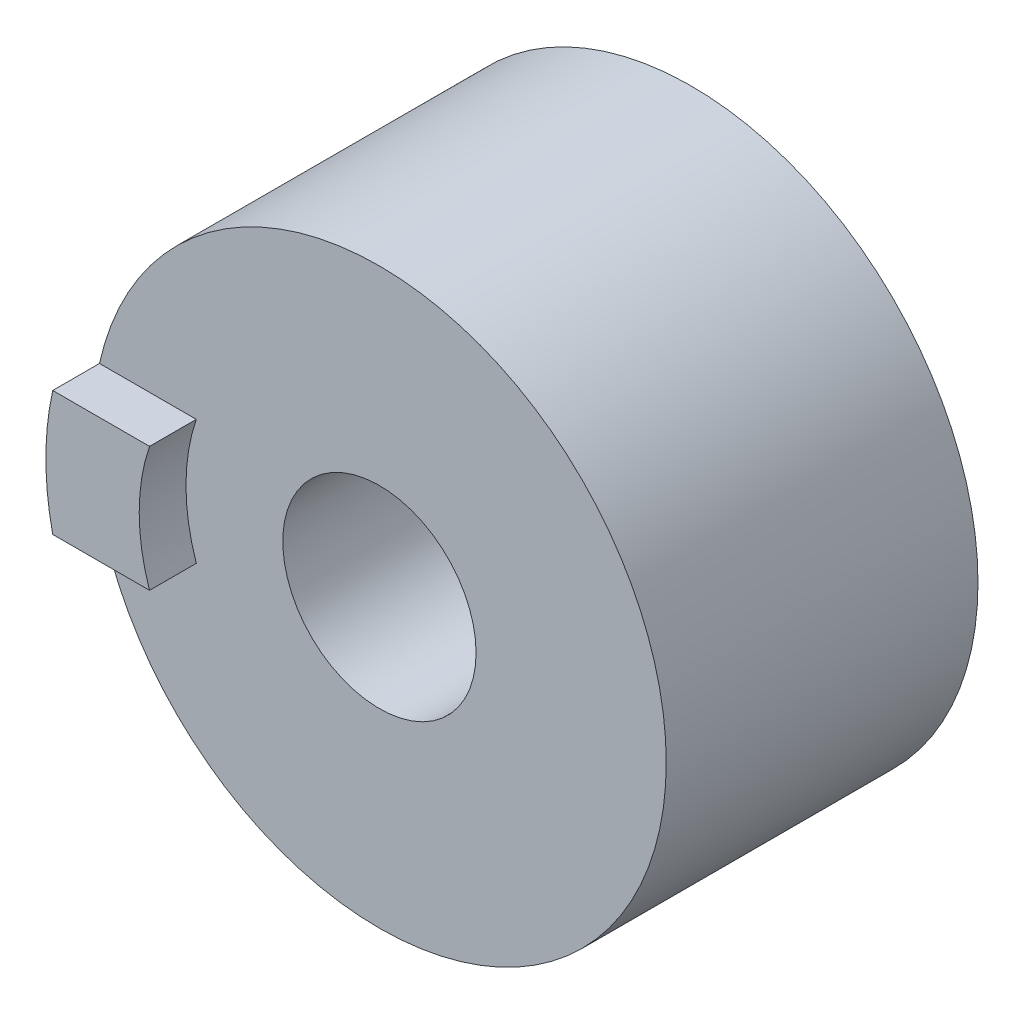
ISO-10303-21;
HEADER;
FILE_DESCRIPTION(('STEP AP214'),'2;1');
FILE_NAME('part.step','',(''),(''),'','','');
FILE_SCHEMA(('AUTOMOTIVE_DESIGN { 1 0 10303 214 1 1 1 1 }'));
ENDSEC;
DATA;
#1=APPLICATION_CONTEXT('core data for automotive mechanical design processes');
#2=APPLICATION_PROTOCOL_DEFINITION('international standard','automotive_design',2000,#1);
#3=PRODUCT_CONTEXT('',#1,'mechanical');
#4=PRODUCT('Part','Part','',(#3));
#5=PRODUCT_RELATED_PRODUCT_CATEGORY('part','',(#4));
#6=PRODUCT_DEFINITION_FORMATION('','',#4);
#7=PRODUCT_DEFINITION_CONTEXT('part definition',#1,'design');
#8=PRODUCT_DEFINITION('design','',#6,#7);
#9=PRODUCT_DEFINITION_SHAPE('','',#8);
#10=(LENGTH_UNIT() NAMED_UNIT(*) SI_UNIT(.MILLI.,.METRE.));
#11=(NAMED_UNIT(*) PLANE_ANGLE_UNIT() SI_UNIT($,.RADIAN.));
#12=(NAMED_UNIT(*) SI_UNIT($,.STERADIAN.) SOLID_ANGLE_UNIT());
#13=UNCERTAINTY_MEASURE_WITH_UNIT(LENGTH_MEASURE(1.E-05),#10,'distance_accuracy_value','');
#14=(GEOMETRIC_REPRESENTATION_CONTEXT(3) GLOBAL_UNCERTAINTY_ASSIGNED_CONTEXT((#13)) GLOBAL_UNIT_ASSIGNED_CONTEXT((#10,
#11,#12)) REPRESENTATION_CONTEXT('',''));
#15=CARTESIAN_POINT('',(0.,0.,0.));
#16=DIRECTION('',(0.,0.,1.));
#17=DIRECTION('',(1.,0.,0.));
#18=AXIS2_PLACEMENT_3D('',#15,#16,#17);
#19=CARTESIAN_POINT('',(0.,0.,7.));
#20=DIRECTION('',(0.,0.,-1.));
#21=DIRECTION('',(-1.,0.,0.));
#22=AXIS2_PLACEMENT_3D('',#19,#20,#21);
#23=PLANE('',#22);
#24=CARTESIAN_POINT('',(4.6,0.,7.));
#25=DIRECTION('',(0.,0.,1.));
#26=DIRECTION('',(1.,0.,0.));
#27=AXIS2_PLACEMENT_3D('',#24,#25,#26);
#28=CIRCLE('',#27,1.55);
#29=CARTESIAN_POINT('',(6.15,0.,7.));
#30=VERTEX_POINT('',#29);
#31=EDGE_CURVE('E99',#30,#30,#28,.T.);
#32=ORIENTED_EDGE('',*,*,#31,.F.);
#33=EDGE_LOOP('',(#32));
#34=FACE_BOUND('',#33,.T.);
#35=DIRECTION('',(-1.,0.,0.));
#36=VECTOR('',#35,1.);
#37=CARTESIAN_POINT('',(0.110011135871271,1.,7.));
#38=LINE('',#37,#36);
#39=CARTESIAN_POINT('',(1.66261939997628,1.,7.));
#40=VERTEX_POINT('',#39);
#41=CARTESIAN_POINT('',(0.110011135871272,1.,7.));
#42=VERTEX_POINT('',#41);
#43=EDGE_CURVE('E51',#40,#42,#38,.T.);
#44=ORIENTED_EDGE('',*,*,#43,.F.);
#45=CARTESIAN_POINT('',(4.6,0.,7.));
#46=DIRECTION('',(0.,0.,-1.));
#47=DIRECTION('',(-1.,0.,0.));
#48=AXIS2_PLACEMENT_3D('',#45,#46,#47);
#49=CIRCLE('',#48,3.10293486708885);
#50=CARTESIAN_POINT('',(1.66261939997628,-1.,7.));
#51=VERTEX_POINT('',#50);
#52=EDGE_CURVE('E190',#51,#40,#49,.T.);
#53=ORIENTED_EDGE('',*,*,#52,.F.);
#54=DIRECTION('',(1.,0.,0.));
#55=VECTOR('',#54,1.);
#56=CARTESIAN_POINT('',(1.66261939997628,-1.,7.));
#57=LINE('',#56,#55);
#58=CARTESIAN_POINT('',(0.110011135871272,-1.,7.));
#59=VERTEX_POINT('',#58);
#60=EDGE_CURVE('E56',#59,#51,#57,.T.);
#61=ORIENTED_EDGE('',*,*,#60,.F.);
#62=CARTESIAN_POINT('',(4.6,0.,7.));
#63=DIRECTION('',(0.,0.,1.));
#64=DIRECTION('',(1.,0.,0.));
#65=AXIS2_PLACEMENT_3D('',#62,#63,#64);
#66=CIRCLE('',#65,4.6);
#67=EDGE_CURVE('E98',#59,#42,#66,.T.);
#68=ORIENTED_EDGE('',*,*,#67,.T.);
#69=EDGE_LOOP('',(#44,#53,#61,#68));
#70=FACE_BOUND('',#69,.T.);
#71=ADVANCED_FACE('F36',(#34,#70),#23,.F.);
#72=CARTESIAN_POINT('',(4.6,0.,0.));
#73=DIRECTION('',(0.,0.,1.));
#74=DIRECTION('',(1.,0.,0.));
#75=AXIS2_PLACEMENT_3D('',#72,#73,#74);
#76=CYLINDRICAL_SURFACE('',#75,1.55);
#77=ORIENTED_EDGE('',*,*,#31,.T.);
#78=EDGE_LOOP('',(#77));
#79=FACE_BOUND('',#78,.T.);
#80=CARTESIAN_POINT('',(4.6,0.,0.));
#81=DIRECTION('',(0.,0.,1.));
#82=DIRECTION('',(1.,0.,0.));
#83=AXIS2_PLACEMENT_3D('',#80,#81,#82);
#84=CIRCLE('',#83,1.55);
#85=CARTESIAN_POINT('',(6.15,0.,0.));
#86=VERTEX_POINT('',#85);
#87=EDGE_CURVE('E11',#86,#86,#84,.T.);
#88=ORIENTED_EDGE('',*,*,#87,.F.);
#89=EDGE_LOOP('',(#88));
#90=FACE_BOUND('',#89,.T.);
#91=ADVANCED_FACE('F38',(#79,#90),#76,.F.);
#92=CARTESIAN_POINT('',(4.6,0.,2.));
#93=DIRECTION('',(0.,0.,1.));
#94=DIRECTION('',(1.,0.,0.));
#95=AXIS2_PLACEMENT_3D('',#92,#93,#94);
#96=CONICAL_SURFACE('',#95,4.6,0.990398139401022);
#97=ORIENTED_EDGE('',*,*,#87,.T.);
#98=EDGE_LOOP('',(#97));
#99=FACE_BOUND('',#98,.T.);
#100=CARTESIAN_POINT('',(4.6,0.,2.));
#101=DIRECTION('',(0.,0.,1.));
#102=DIRECTION('',(1.,0.,0.));
#103=AXIS2_PLACEMENT_3D('',#100,#101,#102);
#104=CIRCLE('',#103,4.6);
#105=CARTESIAN_POINT('',(9.2,0.,2.));
#106=VERTEX_POINT('',#105);
#107=EDGE_CURVE('E44',#106,#106,#104,.T.);
#108=ORIENTED_EDGE('',*,*,#107,.F.);
#109=EDGE_LOOP('',(#108));
#110=FACE_BOUND('',#109,.T.);
#111=ADVANCED_FACE('F110',(#99,#110),#96,.T.);
#112=CARTESIAN_POINT('',(4.6,0.,0.));
#113=DIRECTION('',(0.,0.,1.));
#114=DIRECTION('',(1.,0.,0.));
#115=AXIS2_PLACEMENT_3D('',#112,#113,#114);
#116=CYLINDRICAL_SURFACE('',#115,4.6);
#117=ORIENTED_EDGE('',*,*,#67,.F.);
#118=DIRECTION('',(0.,0.,-1.));
#119=VECTOR('',#118,1.);
#120=CARTESIAN_POINT('',(0.110011135871271,-1.,7.75));
#121=LINE('',#120,#119);
#122=CARTESIAN_POINT('',(0.110011135871271,-1.,7.75));
#123=VERTEX_POINT('',#122);
#124=EDGE_CURVE('E80',#123,#59,#121,.T.);
#125=ORIENTED_EDGE('',*,*,#124,.F.);
#126=CARTESIAN_POINT('',(4.6,0.,7.75));
#127=DIRECTION('',(0.,0.,1.));
#128=DIRECTION('',(-1.,0.,0.));
#129=AXIS2_PLACEMENT_3D('',#126,#127,#128);
#130=CIRCLE('',#129,4.6);
#131=CARTESIAN_POINT('',(0.110011135871271,1.,7.75));
#132=VERTEX_POINT('',#131);
#133=EDGE_CURVE('E86',#132,#123,#130,.T.);
#134=ORIENTED_EDGE('',*,*,#133,.F.);
#135=DIRECTION('',(0.,0.,-1.));
#136=VECTOR('',#135,1.);
#137=CARTESIAN_POINT('',(0.110011135871271,1.,7.75));
#138=LINE('',#137,#136);
#139=EDGE_CURVE('E188',#132,#42,#138,.T.);
#140=ORIENTED_EDGE('',*,*,#139,.T.);
#141=EDGE_LOOP('',(#117,#125,#134,#140));
#142=FACE_BOUND('',#141,.T.);
#143=ORIENTED_EDGE('',*,*,#107,.T.);
#144=EDGE_LOOP('',(#143));
#145=FACE_BOUND('',#144,.T.);
#146=ADVANCED_FACE('F96',(#142,#145),#116,.T.);
#147=CARTESIAN_POINT('',(1.66261939997628,-1.,7.75));
#148=DIRECTION('',(0.,1.,0.));
#149=DIRECTION('',(0.,0.,1.));
#150=AXIS2_PLACEMENT_3D('',#147,#148,#149);
#151=PLANE('',#150);
#152=ORIENTED_EDGE('',*,*,#60,.T.);
#153=DIRECTION('',(0.,0.,-1.));
#154=VECTOR('',#153,1.);
#155=CARTESIAN_POINT('',(1.66261939997628,-1.,7.75));
#156=LINE('',#155,#154);
#157=CARTESIAN_POINT('',(1.66261939997628,-1.,7.75));
#158=VERTEX_POINT('',#157);
#159=EDGE_CURVE('E82',#158,#51,#156,.T.);
#160=ORIENTED_EDGE('',*,*,#159,.F.);
#161=DIRECTION('',(1.,0.,0.));
#162=VECTOR('',#161,1.);
#163=CARTESIAN_POINT('',(1.66261939997628,-1.,7.75));
#164=LINE('',#163,#162);
#165=EDGE_CURVE('E76',#123,#158,#164,.T.);
#166=ORIENTED_EDGE('',*,*,#165,.F.);
#167=ORIENTED_EDGE('',*,*,#124,.T.);
#168=EDGE_LOOP('',(#152,#160,#166,#167));
#169=FACE_BOUND('',#168,.T.);
#170=ADVANCED_FACE('F78',(#169),#151,.F.);
#171=CARTESIAN_POINT('',(4.6,0.,7.75));
#172=DIRECTION('',(0.,0.,-1.));
#173=DIRECTION('',(-1.,0.,0.));
#174=AXIS2_PLACEMENT_3D('',#171,#172,#173);
#175=CYLINDRICAL_SURFACE('',#174,3.10293486708885);
#176=ORIENTED_EDGE('',*,*,#52,.T.);
#177=DIRECTION('',(0.,0.,-1.));
#178=VECTOR('',#177,1.);
#179=CARTESIAN_POINT('',(1.66261939997628,1.,7.75));
#180=LINE('',#179,#178);
#181=CARTESIAN_POINT('',(1.66261939997628,1.,7.75));
#182=VERTEX_POINT('',#181);
#183=EDGE_CURVE('E103',#182,#40,#180,.T.);
#184=ORIENTED_EDGE('',*,*,#183,.F.);
#185=CARTESIAN_POINT('',(4.6,0.,7.75));
#186=DIRECTION('',(0.,0.,-1.));
#187=DIRECTION('',(1.,0.,0.));
#188=AXIS2_PLACEMENT_3D('',#185,#186,#187);
#189=CIRCLE('',#188,3.10293486708885);
#190=EDGE_CURVE('E85',#158,#182,#189,.T.);
#191=ORIENTED_EDGE('',*,*,#190,.F.);
#192=ORIENTED_EDGE('',*,*,#159,.T.);
#193=EDGE_LOOP('',(#176,#184,#191,#192));
#194=FACE_BOUND('',#193,.T.);
#195=ADVANCED_FACE('F128',(#194),#175,.F.);
#196=CARTESIAN_POINT('',(0.110011135871271,1.,7.75));
#197=DIRECTION('',(0.,-1.,0.));
#198=DIRECTION('',(0.,0.,-1.));
#199=AXIS2_PLACEMENT_3D('',#196,#197,#198);
#200=PLANE('',#199);
#201=ORIENTED_EDGE('',*,*,#43,.T.);
#202=ORIENTED_EDGE('',*,*,#139,.F.);
#203=DIRECTION('',(-1.,0.,0.));
#204=VECTOR('',#203,1.);
#205=CARTESIAN_POINT('',(0.110011135871271,1.,7.75));
#206=LINE('',#205,#204);
#207=EDGE_CURVE('E91',#182,#132,#206,.T.);
#208=ORIENTED_EDGE('',*,*,#207,.F.);
#209=ORIENTED_EDGE('',*,*,#183,.T.);
#210=EDGE_LOOP('',(#201,#202,#208,#209));
#211=FACE_BOUND('',#210,.T.);
#212=ADVANCED_FACE('F131',(#211),#200,.F.);
#213=CARTESIAN_POINT('',(4.6,0.,7.75));
#214=DIRECTION('',(0.,0.,-1.));
#215=DIRECTION('',(-1.,0.,0.));
#216=AXIS2_PLACEMENT_3D('',#213,#214,#215);
#217=PLANE('',#216);
#218=ORIENTED_EDGE('',*,*,#133,.T.);
#219=ORIENTED_EDGE('',*,*,#165,.T.);
#220=ORIENTED_EDGE('',*,*,#190,.T.);
#221=ORIENTED_EDGE('',*,*,#207,.T.);
#222=EDGE_LOOP('',(#218,#219,#220,#221));
#223=FACE_BOUND('',#222,.T.);
#224=ADVANCED_FACE('F89',(#223),#217,.F.);
#225=CLOSED_SHELL('',(#71,#91,#111,#146,#170,#195,#212,#224));
#226=MANIFOLD_SOLID_BREP('B2',#225);
#227=ADVANCED_BREP_SHAPE_REPRESENTATION('',(#18,#226),#14);
#228=SHAPE_DEFINITION_REPRESENTATION(#9,#227);
ENDSEC;
END-ISO-10303-21;
